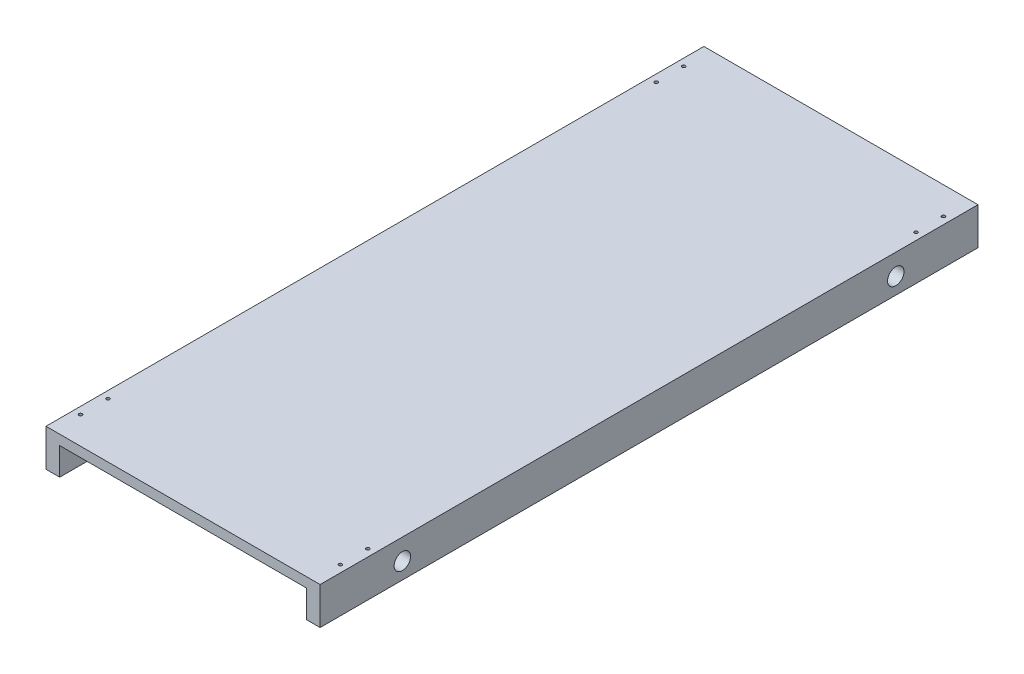
ISO-10303-21;
HEADER;
FILE_DESCRIPTION(('STEP AP214'),'2;1');
FILE_NAME('part.step','',(''),(''),'','','');
FILE_SCHEMA(('AUTOMOTIVE_DESIGN { 1 0 10303 214 1 1 1 1 }'));
ENDSEC;
DATA;
#1=APPLICATION_CONTEXT('core data for automotive mechanical design processes');
#2=APPLICATION_PROTOCOL_DEFINITION('international standard','automotive_design',2000,#1);
#3=PRODUCT_CONTEXT('',#1,'mechanical');
#4=PRODUCT('Part','Part','',(#3));
#5=PRODUCT_RELATED_PRODUCT_CATEGORY('part','',(#4));
#6=PRODUCT_DEFINITION_FORMATION('','',#4);
#7=PRODUCT_DEFINITION_CONTEXT('part definition',#1,'design');
#8=PRODUCT_DEFINITION('design','',#6,#7);
#9=PRODUCT_DEFINITION_SHAPE('','',#8);
#10=(LENGTH_UNIT() NAMED_UNIT(*) SI_UNIT(.MILLI.,.METRE.));
#11=(NAMED_UNIT(*) PLANE_ANGLE_UNIT() SI_UNIT($,.RADIAN.));
#12=(NAMED_UNIT(*) SI_UNIT($,.STERADIAN.) SOLID_ANGLE_UNIT());
#13=UNCERTAINTY_MEASURE_WITH_UNIT(LENGTH_MEASURE(1.E-05),#10,'distance_accuracy_value','');
#14=(GEOMETRIC_REPRESENTATION_CONTEXT(3) GLOBAL_UNCERTAINTY_ASSIGNED_CONTEXT((#13)) GLOBAL_UNIT_ASSIGNED_CONTEXT((#10,
#11,#12)) REPRESENTATION_CONTEXT('',''));
#15=CARTESIAN_POINT('',(0.,0.,0.));
#16=DIRECTION('',(0.,0.,1.));
#17=DIRECTION('',(1.,0.,0.));
#18=AXIS2_PLACEMENT_3D('',#15,#16,#17);
#19=CARTESIAN_POINT('',(25.,0.,1200.));
#20=DIRECTION('',(1.,0.,0.));
#21=DIRECTION('',(0.,1.,0.));
#22=AXIS2_PLACEMENT_3D('',#19,#20,#21);
#23=PLANE('',#22);
#24=CARTESIAN_POINT('',(25.,-20.,1050.));
#25=DIRECTION('',(1.,0.,0.));
#26=DIRECTION('',(0.,1.,0.));
#27=AXIS2_PLACEMENT_3D('',#24,#25,#26);
#28=CIRCLE('',#27,14.9999999999999);
#29=CARTESIAN_POINT('',(25.,-5.00000000000004,1050.));
#30=VERTEX_POINT('',#29);
#31=EDGE_CURVE('E132',#30,#30,#28,.T.);
#32=ORIENTED_EDGE('',*,*,#31,.F.);
#33=EDGE_LOOP('',(#32));
#34=FACE_BOUND('',#33,.T.);
#35=CARTESIAN_POINT('',(25.,-20.,150.));
#36=DIRECTION('',(1.,0.,0.));
#37=DIRECTION('',(0.,1.,0.));
#38=AXIS2_PLACEMENT_3D('',#35,#36,#37);
#39=CIRCLE('',#38,15.);
#40=CARTESIAN_POINT('',(25.,-4.99999999999993,150.));
#41=VERTEX_POINT('',#40);
#42=EDGE_CURVE('E184',#41,#41,#39,.T.);
#43=ORIENTED_EDGE('',*,*,#42,.F.);
#44=EDGE_LOOP('',(#43));
#45=FACE_BOUND('',#44,.T.);
#46=DIRECTION('',(0.,-1.,0.));
#47=VECTOR('',#46,1.);
#48=CARTESIAN_POINT('',(25.,0.,0.));
#49=LINE('',#48,#47);
#50=CARTESIAN_POINT('',(25.,0.,0.));
#51=VERTEX_POINT('',#50);
#52=CARTESIAN_POINT('',(25.,-50.,0.));
#53=VERTEX_POINT('',#52);
#54=EDGE_CURVE('E128',#51,#53,#49,.T.);
#55=ORIENTED_EDGE('',*,*,#54,.F.);
#56=DIRECTION('',(0.,0.,-1.));
#57=VECTOR('',#56,1.);
#58=CARTESIAN_POINT('',(25.,0.,1200.));
#59=LINE('',#58,#57);
#60=CARTESIAN_POINT('',(25.,0.,1200.));
#61=VERTEX_POINT('',#60);
#62=EDGE_CURVE('E11',#61,#51,#59,.T.);
#63=ORIENTED_EDGE('',*,*,#62,.F.);
#64=DIRECTION('',(0.,-1.,0.));
#65=VECTOR('',#64,1.);
#66=CARTESIAN_POINT('',(25.,0.,1200.));
#67=LINE('',#66,#65);
#68=CARTESIAN_POINT('',(25.,-50.,1200.));
#69=VERTEX_POINT('',#68);
#70=EDGE_CURVE('E147',#61,#69,#67,.T.);
#71=ORIENTED_EDGE('',*,*,#70,.T.);
#72=DIRECTION('',(0.,0.,-1.));
#73=VECTOR('',#72,1.);
#74=CARTESIAN_POINT('',(25.,-50.,1200.));
#75=LINE('',#74,#73);
#76=EDGE_CURVE('E83',#69,#53,#75,.T.);
#77=ORIENTED_EDGE('',*,*,#76,.T.);
#78=EDGE_LOOP('',(#55,#63,#71,#77));
#79=FACE_BOUND('',#78,.T.);
#80=ADVANCED_FACE('F33',(#34,#45,#79),#23,.T.);
#81=CARTESIAN_POINT('',(0.,0.,1200.));
#82=DIRECTION('',(0.,1.,0.));
#83=DIRECTION('',(-1.,0.,0.));
#84=AXIS2_PLACEMENT_3D('',#81,#82,#83);
#85=PLANE('',#84);
#86=DIRECTION('',(1.,0.,0.));
#87=VECTOR('',#86,1.);
#88=CARTESIAN_POINT('',(0.,0.,0.));
#89=LINE('',#88,#87);
#90=CARTESIAN_POINT('',(475.,0.,0.));
#91=VERTEX_POINT('',#90);
#92=EDGE_CURVE('E131',#51,#91,#89,.T.);
#93=ORIENTED_EDGE('',*,*,#92,.T.);
#94=DIRECTION('',(0.,0.,-1.));
#95=VECTOR('',#94,1.);
#96=CARTESIAN_POINT('',(475.,0.,1200.));
#97=LINE('',#96,#95);
#98=CARTESIAN_POINT('',(475.,0.,1200.));
#99=VERTEX_POINT('',#98);
#100=EDGE_CURVE('E41',#99,#91,#97,.T.);
#101=ORIENTED_EDGE('',*,*,#100,.F.);
#102=DIRECTION('',(1.,0.,0.));
#103=VECTOR('',#102,1.);
#104=CARTESIAN_POINT('',(0.,0.,1200.));
#105=LINE('',#104,#103);
#106=EDGE_CURVE('E171',#61,#99,#105,.T.);
#107=ORIENTED_EDGE('',*,*,#106,.F.);
#108=ORIENTED_EDGE('',*,*,#62,.T.);
#109=EDGE_LOOP('',(#93,#101,#107,#108));
#110=FACE_BOUND('',#109,.T.);
#111=ADVANCED_FACE('F295',(#110),#85,.F.);
#112=CARTESIAN_POINT('',(475.,-5.27355936696949E-13,1200.));
#113=DIRECTION('',(1.,0.,0.));
#114=DIRECTION('',(0.,1.,0.));
#115=AXIS2_PLACEMENT_3D('',#112,#113,#114);
#116=PLANE('',#115);
#117=CARTESIAN_POINT('',(475.,-20.,1050.));
#118=DIRECTION('',(1.,0.,0.));
#119=DIRECTION('',(0.,1.,0.));
#120=AXIS2_PLACEMENT_3D('',#117,#118,#119);
#121=CIRCLE('',#120,14.9999999999999);
#122=CARTESIAN_POINT('',(475.,-5.00000000000004,1050.));
#123=VERTEX_POINT('',#122);
#124=EDGE_CURVE('E178',#123,#123,#121,.T.);
#125=ORIENTED_EDGE('',*,*,#124,.T.);
#126=EDGE_LOOP('',(#125));
#127=FACE_BOUND('',#126,.T.);
#128=CARTESIAN_POINT('',(475.,-20.,150.));
#129=DIRECTION('',(1.,0.,0.));
#130=DIRECTION('',(0.,1.,0.));
#131=AXIS2_PLACEMENT_3D('',#128,#129,#130);
#132=CIRCLE('',#131,15.);
#133=CARTESIAN_POINT('',(475.,-4.99999999999993,150.));
#134=VERTEX_POINT('',#133);
#135=EDGE_CURVE('E187',#134,#134,#132,.T.);
#136=ORIENTED_EDGE('',*,*,#135,.T.);
#137=EDGE_LOOP('',(#136));
#138=FACE_BOUND('',#137,.T.);
#139=DIRECTION('',(0.,-1.,0.));
#140=VECTOR('',#139,1.);
#141=CARTESIAN_POINT('',(475.,-5.27355936696949E-13,0.));
#142=LINE('',#141,#140);
#143=CARTESIAN_POINT('',(475.,-50.,0.));
#144=VERTEX_POINT('',#143);
#145=EDGE_CURVE('E134',#91,#144,#142,.T.);
#146=ORIENTED_EDGE('',*,*,#145,.T.);
#147=DIRECTION('',(0.,0.,-1.));
#148=VECTOR('',#147,1.);
#149=CARTESIAN_POINT('',(475.,-50.,1200.));
#150=LINE('',#149,#148);
#151=CARTESIAN_POINT('',(475.,-50.,1200.));
#152=VERTEX_POINT('',#151);
#153=EDGE_CURVE('E153',#152,#144,#150,.T.);
#154=ORIENTED_EDGE('',*,*,#153,.F.);
#155=DIRECTION('',(0.,-1.,0.));
#156=VECTOR('',#155,1.);
#157=CARTESIAN_POINT('',(475.,-5.27355936696949E-13,1200.));
#158=LINE('',#157,#156);
#159=EDGE_CURVE('E161',#99,#152,#158,.T.);
#160=ORIENTED_EDGE('',*,*,#159,.F.);
#161=ORIENTED_EDGE('',*,*,#100,.T.);
#162=EDGE_LOOP('',(#146,#154,#160,#161));
#163=FACE_BOUND('',#162,.T.);
#164=ADVANCED_FACE('F159',(#127,#138,#163),#116,.F.);
#165=CARTESIAN_POINT('',(0.,-49.9999999999998,1200.));
#166=DIRECTION('',(0.,-1.,0.));
#167=DIRECTION('',(1.,0.,0.));
#168=AXIS2_PLACEMENT_3D('',#165,#166,#167);
#169=PLANE('',#168);
#170=CARTESIAN_POINT('',(487.,-50.,50.));
#171=DIRECTION('',(0.,1.,0.));
#172=DIRECTION('',(0.,0.,1.));
#173=AXIS2_PLACEMENT_3D('',#170,#171,#172);
#174=CIRCLE('',#173,2.99999999999998);
#175=CARTESIAN_POINT('',(487.,-50.,53.));
#176=VERTEX_POINT('',#175);
#177=EDGE_CURVE('E244',#176,#176,#174,.T.);
#178=ORIENTED_EDGE('',*,*,#177,.T.);
#179=EDGE_LOOP('',(#178));
#180=FACE_BOUND('',#179,.T.);
#181=CARTESIAN_POINT('',(487.,-50.,100.));
#182=DIRECTION('',(0.,1.,0.));
#183=DIRECTION('',(0.,0.,1.));
#184=AXIS2_PLACEMENT_3D('',#181,#182,#183);
#185=CIRCLE('',#184,2.99999999999998);
#186=CARTESIAN_POINT('',(487.,-50.,103.));
#187=VERTEX_POINT('',#186);
#188=EDGE_CURVE('E226',#187,#187,#185,.T.);
#189=ORIENTED_EDGE('',*,*,#188,.T.);
#190=EDGE_LOOP('',(#189));
#191=FACE_BOUND('',#190,.T.);
#192=CARTESIAN_POINT('',(487.,-50.,1150.));
#193=DIRECTION('',(0.,1.,0.));
#194=DIRECTION('',(0.,0.,1.));
#195=AXIS2_PLACEMENT_3D('',#192,#193,#194);
#196=CIRCLE('',#195,2.99999999999998);
#197=CARTESIAN_POINT('',(487.,-50.,1153.));
#198=VERTEX_POINT('',#197);
#199=EDGE_CURVE('E209',#198,#198,#196,.T.);
#200=ORIENTED_EDGE('',*,*,#199,.T.);
#201=EDGE_LOOP('',(#200));
#202=FACE_BOUND('',#201,.T.);
#203=CARTESIAN_POINT('',(487.,-50.,1100.));
#204=DIRECTION('',(0.,1.,0.));
#205=DIRECTION('',(0.,0.,1.));
#206=AXIS2_PLACEMENT_3D('',#203,#204,#205);
#207=CIRCLE('',#206,2.99999999999998);
#208=CARTESIAN_POINT('',(487.,-50.,1103.));
#209=VERTEX_POINT('',#208);
#210=EDGE_CURVE('E210',#209,#209,#207,.T.);
#211=ORIENTED_EDGE('',*,*,#210,.T.);
#212=EDGE_LOOP('',(#211));
#213=FACE_BOUND('',#212,.T.);
#214=DIRECTION('',(-1.,0.,0.));
#215=VECTOR('',#214,1.);
#216=CARTESIAN_POINT('',(0.,-49.9999999999998,0.));
#217=LINE('',#216,#215);
#218=CARTESIAN_POINT('',(500.,-50.,0.));
#219=VERTEX_POINT('',#218);
#220=EDGE_CURVE('E137',#219,#144,#217,.T.);
#221=ORIENTED_EDGE('',*,*,#220,.F.);
#222=DIRECTION('',(0.,0.,-1.));
#223=VECTOR('',#222,1.);
#224=CARTESIAN_POINT('',(500.,-50.,1200.));
#225=LINE('',#224,#223);
#226=CARTESIAN_POINT('',(500.,-50.,1200.));
#227=VERTEX_POINT('',#226);
#228=EDGE_CURVE('E151',#227,#219,#225,.T.);
#229=ORIENTED_EDGE('',*,*,#228,.F.);
#230=DIRECTION('',(-1.,0.,0.));
#231=VECTOR('',#230,1.);
#232=CARTESIAN_POINT('',(0.,-49.9999999999998,1200.));
#233=LINE('',#232,#231);
#234=EDGE_CURVE('E123',#227,#152,#233,.T.);
#235=ORIENTED_EDGE('',*,*,#234,.T.);
#236=ORIENTED_EDGE('',*,*,#153,.T.);
#237=EDGE_LOOP('',(#221,#229,#235,#236));
#238=FACE_BOUND('',#237,.T.);
#239=ADVANCED_FACE('F169',(#180,#191,#202,#213,#238),#169,.T.);
#240=CARTESIAN_POINT('',(500.,0.,1200.));
#241=DIRECTION('',(-1.,0.,0.));
#242=DIRECTION('',(0.,0.,1.));
#243=AXIS2_PLACEMENT_3D('',#240,#241,#242);
#244=PLANE('',#243);
#245=CARTESIAN_POINT('',(500.,-20.,1050.));
#246=DIRECTION('',(-1.,0.,0.));
#247=DIRECTION('',(0.,0.,1.));
#248=AXIS2_PLACEMENT_3D('',#245,#246,#247);
#249=CIRCLE('',#248,14.9999999999999);
#250=CARTESIAN_POINT('',(500.,-20.,1065.));
#251=VERTEX_POINT('',#250);
#252=EDGE_CURVE('E181',#251,#251,#249,.T.);
#253=ORIENTED_EDGE('',*,*,#252,.T.);
#254=EDGE_LOOP('',(#253));
#255=FACE_BOUND('',#254,.T.);
#256=CARTESIAN_POINT('',(500.,-20.,150.));
#257=DIRECTION('',(-1.,0.,0.));
#258=DIRECTION('',(0.,0.,1.));
#259=AXIS2_PLACEMENT_3D('',#256,#257,#258);
#260=CIRCLE('',#259,15.);
#261=CARTESIAN_POINT('',(500.,-20.,165.));
#262=VERTEX_POINT('',#261);
#263=EDGE_CURVE('E190',#262,#262,#260,.T.);
#264=ORIENTED_EDGE('',*,*,#263,.T.);
#265=EDGE_LOOP('',(#264));
#266=FACE_BOUND('',#265,.T.);
#267=DIRECTION('',(0.,1.,0.));
#268=VECTOR('',#267,1.);
#269=CARTESIAN_POINT('',(500.,0.,0.));
#270=LINE('',#269,#268);
#271=CARTESIAN_POINT('',(500.,18.,0.));
#272=VERTEX_POINT('',#271);
#273=EDGE_CURVE('E140',#219,#272,#270,.T.);
#274=ORIENTED_EDGE('',*,*,#273,.T.);
#275=DIRECTION('',(0.,0.,-1.));
#276=VECTOR('',#275,1.);
#277=CARTESIAN_POINT('',(500.,18.,1200.));
#278=LINE('',#277,#276);
#279=CARTESIAN_POINT('',(500.,18.,1200.));
#280=VERTEX_POINT('',#279);
#281=EDGE_CURVE('E111',#280,#272,#278,.T.);
#282=ORIENTED_EDGE('',*,*,#281,.F.);
#283=DIRECTION('',(0.,1.,0.));
#284=VECTOR('',#283,1.);
#285=CARTESIAN_POINT('',(500.,0.,1200.));
#286=LINE('',#285,#284);
#287=EDGE_CURVE('E120',#227,#280,#286,.T.);
#288=ORIENTED_EDGE('',*,*,#287,.F.);
#289=ORIENTED_EDGE('',*,*,#228,.T.);
#290=EDGE_LOOP('',(#274,#282,#288,#289));
#291=FACE_BOUND('',#290,.T.);
#292=ADVANCED_FACE('F259',(#255,#266,#291),#244,.F.);
#293=CARTESIAN_POINT('',(0.,18.,1200.));
#294=DIRECTION('',(0.,1.,0.));
#295=DIRECTION('',(0.,0.,1.));
#296=AXIS2_PLACEMENT_3D('',#293,#294,#295);
#297=PLANE('',#296);
#298=CARTESIAN_POINT('',(487.,18.,50.));
#299=DIRECTION('',(0.,1.,0.));
#300=DIRECTION('',(0.,0.,1.));
#301=AXIS2_PLACEMENT_3D('',#298,#299,#300);
#302=CIRCLE('',#301,2.99999999999999);
#303=CARTESIAN_POINT('',(487.,18.,53.));
#304=VERTEX_POINT('',#303);
#305=EDGE_CURVE('E241',#304,#304,#302,.T.);
#306=ORIENTED_EDGE('',*,*,#305,.F.);
#307=EDGE_LOOP('',(#306));
#308=FACE_BOUND('',#307,.T.);
#309=CARTESIAN_POINT('',(13.,18.,50.));
#310=DIRECTION('',(0.,1.,0.));
#311=DIRECTION('',(0.,0.,1.));
#312=AXIS2_PLACEMENT_3D('',#309,#310,#311);
#313=CIRCLE('',#312,2.99999999999999);
#314=CARTESIAN_POINT('',(13.,18.,53.));
#315=VERTEX_POINT('',#314);
#316=EDGE_CURVE('E235',#315,#315,#313,.T.);
#317=ORIENTED_EDGE('',*,*,#316,.F.);
#318=EDGE_LOOP('',(#317));
#319=FACE_BOUND('',#318,.T.);
#320=CARTESIAN_POINT('',(13.,18.,100.));
#321=DIRECTION('',(0.,1.,0.));
#322=DIRECTION('',(0.,0.,1.));
#323=AXIS2_PLACEMENT_3D('',#320,#321,#322);
#324=CIRCLE('',#323,2.99999999999999);
#325=CARTESIAN_POINT('',(13.,18.,103.));
#326=VERTEX_POINT('',#325);
#327=EDGE_CURVE('E229',#326,#326,#324,.T.);
#328=ORIENTED_EDGE('',*,*,#327,.F.);
#329=EDGE_LOOP('',(#328));
#330=FACE_BOUND('',#329,.T.);
#331=CARTESIAN_POINT('',(487.,18.,100.));
#332=DIRECTION('',(0.,1.,0.));
#333=DIRECTION('',(0.,0.,1.));
#334=AXIS2_PLACEMENT_3D('',#331,#332,#333);
#335=CIRCLE('',#334,2.99999999999999);
#336=CARTESIAN_POINT('',(487.,18.,103.));
#337=VERTEX_POINT('',#336);
#338=EDGE_CURVE('E213',#337,#337,#335,.T.);
#339=ORIENTED_EDGE('',*,*,#338,.F.);
#340=EDGE_LOOP('',(#339));
#341=FACE_BOUND('',#340,.T.);
#342=CARTESIAN_POINT('',(13.,18.,1100.));
#343=DIRECTION('',(0.,1.,0.));
#344=DIRECTION('',(0.,0.,1.));
#345=AXIS2_PLACEMENT_3D('',#342,#343,#344);
#346=CIRCLE('',#345,2.99999999999999);
#347=CARTESIAN_POINT('',(13.,18.,1103.));
#348=VERTEX_POINT('',#347);
#349=EDGE_CURVE('E205',#348,#348,#346,.T.);
#350=ORIENTED_EDGE('',*,*,#349,.F.);
#351=EDGE_LOOP('',(#350));
#352=FACE_BOUND('',#351,.T.);
#353=CARTESIAN_POINT('',(487.,18.,1150.));
#354=DIRECTION('',(0.,1.,0.));
#355=DIRECTION('',(0.,0.,1.));
#356=AXIS2_PLACEMENT_3D('',#353,#354,#355);
#357=CIRCLE('',#356,2.99999999999999);
#358=CARTESIAN_POINT('',(487.,18.,1153.));
#359=VERTEX_POINT('',#358);
#360=EDGE_CURVE('E214',#359,#359,#357,.T.);
#361=ORIENTED_EDGE('',*,*,#360,.F.);
#362=EDGE_LOOP('',(#361));
#363=FACE_BOUND('',#362,.T.);
#364=CARTESIAN_POINT('',(487.,18.,1100.));
#365=DIRECTION('',(0.,1.,0.));
#366=DIRECTION('',(0.,0.,1.));
#367=AXIS2_PLACEMENT_3D('',#364,#365,#366);
#368=CIRCLE('',#367,2.99999999999999);
#369=CARTESIAN_POINT('',(487.,18.,1103.));
#370=VERTEX_POINT('',#369);
#371=EDGE_CURVE('E206',#370,#370,#368,.T.);
#372=ORIENTED_EDGE('',*,*,#371,.F.);
#373=EDGE_LOOP('',(#372));
#374=FACE_BOUND('',#373,.T.);
#375=CARTESIAN_POINT('',(13.,18.,1150.));
#376=DIRECTION('',(0.,1.,0.));
#377=DIRECTION('',(0.,0.,1.));
#378=AXIS2_PLACEMENT_3D('',#375,#376,#377);
#379=CIRCLE('',#378,2.99999999999999);
#380=CARTESIAN_POINT('',(13.,18.,1153.));
#381=VERTEX_POINT('',#380);
#382=EDGE_CURVE('E202',#381,#381,#379,.T.);
#383=ORIENTED_EDGE('',*,*,#382,.F.);
#384=EDGE_LOOP('',(#383));
#385=FACE_BOUND('',#384,.T.);
#386=DIRECTION('',(1.,0.,0.));
#387=VECTOR('',#386,1.);
#388=CARTESIAN_POINT('',(0.,18.,0.));
#389=LINE('',#388,#387);
#390=CARTESIAN_POINT('',(0.,18.,0.));
#391=VERTEX_POINT('',#390);
#392=EDGE_CURVE('E110',#391,#272,#389,.T.);
#393=ORIENTED_EDGE('',*,*,#392,.F.);
#394=DIRECTION('',(0.,0.,-1.));
#395=VECTOR('',#394,1.);
#396=CARTESIAN_POINT('',(0.,18.,1200.));
#397=LINE('',#396,#395);
#398=CARTESIAN_POINT('',(0.,18.,1200.));
#399=VERTEX_POINT('',#398);
#400=EDGE_CURVE('E104',#399,#391,#397,.T.);
#401=ORIENTED_EDGE('',*,*,#400,.F.);
#402=DIRECTION('',(1.,0.,0.));
#403=VECTOR('',#402,1.);
#404=CARTESIAN_POINT('',(0.,18.,1200.));
#405=LINE('',#404,#403);
#406=EDGE_CURVE('E108',#399,#280,#405,.T.);
#407=ORIENTED_EDGE('',*,*,#406,.T.);
#408=ORIENTED_EDGE('',*,*,#281,.T.);
#409=EDGE_LOOP('',(#393,#401,#407,#408));
#410=FACE_BOUND('',#409,.T.);
#411=ADVANCED_FACE('F106',(#308,#319,#330,#341,#352,#363,#374,#385,#410),#297,.T.);
#412=CARTESIAN_POINT('',(0.,0.,1200.));
#413=DIRECTION('',(1.,0.,0.));
#414=DIRECTION('',(0.,1.,0.));
#415=AXIS2_PLACEMENT_3D('',#412,#413,#414);
#416=PLANE('',#415);
#417=CARTESIAN_POINT('',(0.,-20.,1050.));
#418=DIRECTION('',(1.,0.,0.));
#419=DIRECTION('',(0.,0.,-1.));
#420=AXIS2_PLACEMENT_3D('',#417,#418,#419);
#421=CIRCLE('',#420,14.9999999999999);
#422=CARTESIAN_POINT('',(0.,-20.,1035.));
#423=VERTEX_POINT('',#422);
#424=EDGE_CURVE('E193',#423,#423,#421,.T.);
#425=ORIENTED_EDGE('',*,*,#424,.T.);
#426=EDGE_LOOP('',(#425));
#427=FACE_BOUND('',#426,.T.);
#428=CARTESIAN_POINT('',(0.,-20.,150.));
#429=DIRECTION('',(1.,0.,0.));
#430=DIRECTION('',(0.,0.,-1.));
#431=AXIS2_PLACEMENT_3D('',#428,#429,#430);
#432=CIRCLE('',#431,15.);
#433=CARTESIAN_POINT('',(0.,-20.,135.));
#434=VERTEX_POINT('',#433);
#435=EDGE_CURVE('E194',#434,#434,#432,.T.);
#436=ORIENTED_EDGE('',*,*,#435,.T.);
#437=EDGE_LOOP('',(#436));
#438=FACE_BOUND('',#437,.T.);
#439=DIRECTION('',(0.,-1.,0.));
#440=VECTOR('',#439,1.);
#441=CARTESIAN_POINT('',(0.,0.,0.));
#442=LINE('',#441,#440);
#443=CARTESIAN_POINT('',(0.,-50.,0.));
#444=VERTEX_POINT('',#443);
#445=EDGE_CURVE('E76',#391,#444,#442,.T.);
#446=ORIENTED_EDGE('',*,*,#445,.T.);
#447=DIRECTION('',(0.,0.,-1.));
#448=VECTOR('',#447,1.);
#449=CARTESIAN_POINT('',(0.,-50.,1200.));
#450=LINE('',#449,#448);
#451=CARTESIAN_POINT('',(0.,-50.,1200.));
#452=VERTEX_POINT('',#451);
#453=EDGE_CURVE('E112',#452,#444,#450,.T.);
#454=ORIENTED_EDGE('',*,*,#453,.F.);
#455=DIRECTION('',(0.,-1.,0.));
#456=VECTOR('',#455,1.);
#457=CARTESIAN_POINT('',(0.,0.,1200.));
#458=LINE('',#457,#456);
#459=EDGE_CURVE('E114',#399,#452,#458,.T.);
#460=ORIENTED_EDGE('',*,*,#459,.F.);
#461=ORIENTED_EDGE('',*,*,#400,.T.);
#462=EDGE_LOOP('',(#446,#454,#460,#461));
#463=FACE_BOUND('',#462,.T.);
#464=ADVANCED_FACE('F115',(#427,#438,#463),#416,.F.);
#465=CARTESIAN_POINT('',(0.,-50.,1200.));
#466=DIRECTION('',(0.,1.,0.));
#467=DIRECTION('',(0.,0.,1.));
#468=AXIS2_PLACEMENT_3D('',#465,#466,#467);
#469=PLANE('',#468);
#470=CARTESIAN_POINT('',(13.,-50.,50.));
#471=DIRECTION('',(0.,1.,0.));
#472=DIRECTION('',(0.,0.,1.));
#473=AXIS2_PLACEMENT_3D('',#470,#471,#472);
#474=CIRCLE('',#473,2.99999999999998);
#475=CARTESIAN_POINT('',(13.,-50.,53.));
#476=VERTEX_POINT('',#475);
#477=EDGE_CURVE('E238',#476,#476,#474,.T.);
#478=ORIENTED_EDGE('',*,*,#477,.T.);
#479=EDGE_LOOP('',(#478));
#480=FACE_BOUND('',#479,.T.);
#481=CARTESIAN_POINT('',(13.,-50.,100.));
#482=DIRECTION('',(0.,1.,0.));
#483=DIRECTION('',(0.,0.,1.));
#484=AXIS2_PLACEMENT_3D('',#481,#482,#483);
#485=CIRCLE('',#484,2.99999999999998);
#486=CARTESIAN_POINT('',(13.,-50.,103.));
#487=VERTEX_POINT('',#486);
#488=EDGE_CURVE('E232',#487,#487,#485,.T.);
#489=ORIENTED_EDGE('',*,*,#488,.T.);
#490=EDGE_LOOP('',(#489));
#491=FACE_BOUND('',#490,.T.);
#492=CARTESIAN_POINT('',(13.,-50.,1100.));
#493=DIRECTION('',(0.,1.,0.));
#494=DIRECTION('',(0.,0.,1.));
#495=AXIS2_PLACEMENT_3D('',#492,#493,#494);
#496=CIRCLE('',#495,2.99999999999998);
#497=CARTESIAN_POINT('',(13.,-50.,1103.));
#498=VERTEX_POINT('',#497);
#499=EDGE_CURVE('E217',#498,#498,#496,.T.);
#500=ORIENTED_EDGE('',*,*,#499,.T.);
#501=EDGE_LOOP('',(#500));
#502=FACE_BOUND('',#501,.T.);
#503=CARTESIAN_POINT('',(13.,-50.,1150.));
#504=DIRECTION('',(0.,1.,0.));
#505=DIRECTION('',(0.,0.,1.));
#506=AXIS2_PLACEMENT_3D('',#503,#504,#505);
#507=CIRCLE('',#506,2.99999999999998);
#508=CARTESIAN_POINT('',(13.,-50.,1153.));
#509=VERTEX_POINT('',#508);
#510=EDGE_CURVE('E197',#509,#509,#507,.T.);
#511=ORIENTED_EDGE('',*,*,#510,.T.);
#512=EDGE_LOOP('',(#511));
#513=FACE_BOUND('',#512,.T.);
#514=DIRECTION('',(1.,0.,0.));
#515=VECTOR('',#514,1.);
#516=CARTESIAN_POINT('',(0.,-50.,0.));
#517=LINE('',#516,#515);
#518=EDGE_CURVE('E145',#444,#53,#517,.T.);
#519=ORIENTED_EDGE('',*,*,#518,.T.);
#520=ORIENTED_EDGE('',*,*,#76,.F.);
#521=DIRECTION('',(1.,0.,0.));
#522=VECTOR('',#521,1.);
#523=CARTESIAN_POINT('',(0.,-50.,1200.));
#524=LINE('',#523,#522);
#525=EDGE_CURVE('E49',#452,#69,#524,.T.);
#526=ORIENTED_EDGE('',*,*,#525,.F.);
#527=ORIENTED_EDGE('',*,*,#453,.T.);
#528=EDGE_LOOP('',(#519,#520,#526,#527));
#529=FACE_BOUND('',#528,.T.);
#530=ADVANCED_FACE('F305',(#480,#491,#502,#513,#529),#469,.F.);
#531=CARTESIAN_POINT('',(0.,0.,1200.));
#532=DIRECTION('',(0.,0.,1.));
#533=DIRECTION('',(1.,0.,0.));
#534=AXIS2_PLACEMENT_3D('',#531,#532,#533);
#535=PLANE('',#534);
#536=ORIENTED_EDGE('',*,*,#70,.F.);
#537=ORIENTED_EDGE('',*,*,#106,.T.);
#538=ORIENTED_EDGE('',*,*,#159,.T.);
#539=ORIENTED_EDGE('',*,*,#234,.F.);
#540=ORIENTED_EDGE('',*,*,#287,.T.);
#541=ORIENTED_EDGE('',*,*,#406,.F.);
#542=ORIENTED_EDGE('',*,*,#459,.T.);
#543=ORIENTED_EDGE('',*,*,#525,.T.);
#544=EDGE_LOOP('',(#536,#537,#538,#539,#540,#541,#542,#543));
#545=FACE_BOUND('',#544,.T.);
#546=ADVANCED_FACE('F117',(#545),#535,.T.);
#547=CARTESIAN_POINT('',(0.,0.,0.));
#548=DIRECTION('',(0.,0.,1.));
#549=DIRECTION('',(1.,0.,0.));
#550=AXIS2_PLACEMENT_3D('',#547,#548,#549);
#551=PLANE('',#550);
#552=ORIENTED_EDGE('',*,*,#54,.T.);
#553=ORIENTED_EDGE('',*,*,#518,.F.);
#554=ORIENTED_EDGE('',*,*,#445,.F.);
#555=ORIENTED_EDGE('',*,*,#392,.T.);
#556=ORIENTED_EDGE('',*,*,#273,.F.);
#557=ORIENTED_EDGE('',*,*,#220,.T.);
#558=ORIENTED_EDGE('',*,*,#145,.F.);
#559=ORIENTED_EDGE('',*,*,#92,.F.);
#560=EDGE_LOOP('',(#552,#553,#554,#555,#556,#557,#558,#559));
#561=FACE_BOUND('',#560,.T.);
#562=ADVANCED_FACE('F165',(#561),#551,.F.);
#563=CARTESIAN_POINT('',(0.,-20.,150.));
#564=DIRECTION('',(1.,0.,0.));
#565=DIRECTION('',(0.,0.,-1.));
#566=AXIS2_PLACEMENT_3D('',#563,#564,#565);
#567=CYLINDRICAL_SURFACE('',#566,15.);
#568=ORIENTED_EDGE('',*,*,#42,.T.);
#569=EDGE_LOOP('',(#568));
#570=FACE_BOUND('',#569,.T.);
#571=ORIENTED_EDGE('',*,*,#435,.F.);
#572=EDGE_LOOP('',(#571));
#573=FACE_BOUND('',#572,.T.);
#574=ADVANCED_FACE('F337',(#570,#573),#567,.F.);
#575=CARTESIAN_POINT('',(0.,-20.,1050.));
#576=DIRECTION('',(1.,0.,0.));
#577=DIRECTION('',(0.,0.,-1.));
#578=AXIS2_PLACEMENT_3D('',#575,#576,#577);
#579=CYLINDRICAL_SURFACE('',#578,14.9999999999999);
#580=ORIENTED_EDGE('',*,*,#31,.T.);
#581=EDGE_LOOP('',(#580));
#582=FACE_BOUND('',#581,.T.);
#583=ORIENTED_EDGE('',*,*,#424,.F.);
#584=EDGE_LOOP('',(#583));
#585=FACE_BOUND('',#584,.T.);
#586=ADVANCED_FACE('F291',(#582,#585),#579,.F.);
#587=ORIENTED_EDGE('',*,*,#263,.F.);
#588=EDGE_LOOP('',(#587));
#589=FACE_BOUND('',#588,.T.);
#590=ORIENTED_EDGE('',*,*,#135,.F.);
#591=EDGE_LOOP('',(#590));
#592=FACE_BOUND('',#591,.T.);
#593=ADVANCED_FACE('F288',(#589,#592),#567,.F.);
#594=ORIENTED_EDGE('',*,*,#252,.F.);
#595=EDGE_LOOP('',(#594));
#596=FACE_BOUND('',#595,.T.);
#597=ORIENTED_EDGE('',*,*,#124,.F.);
#598=EDGE_LOOP('',(#597));
#599=FACE_BOUND('',#598,.T.);
#600=ADVANCED_FACE('F278',(#596,#599),#579,.F.);
#601=CARTESIAN_POINT('',(13.,18.,1150.));
#602=DIRECTION('',(0.,1.,0.));
#603=DIRECTION('',(0.,0.,1.));
#604=AXIS2_PLACEMENT_3D('',#601,#602,#603);
#605=CYLINDRICAL_SURFACE('',#604,2.99999999999999);
#606=ORIENTED_EDGE('',*,*,#510,.F.);
#607=EDGE_LOOP('',(#606));
#608=FACE_BOUND('',#607,.T.);
#609=ORIENTED_EDGE('',*,*,#382,.T.);
#610=EDGE_LOOP('',(#609));
#611=FACE_BOUND('',#610,.T.);
#612=ADVANCED_FACE('F275',(#608,#611),#605,.F.);
#613=CARTESIAN_POINT('',(13.,18.,1100.));
#614=DIRECTION('',(0.,1.,0.));
#615=DIRECTION('',(0.,0.,1.));
#616=AXIS2_PLACEMENT_3D('',#613,#614,#615);
#617=CYLINDRICAL_SURFACE('',#616,2.99999999999999);
#618=ORIENTED_EDGE('',*,*,#499,.F.);
#619=EDGE_LOOP('',(#618));
#620=FACE_BOUND('',#619,.T.);
#621=ORIENTED_EDGE('',*,*,#349,.T.);
#622=EDGE_LOOP('',(#621));
#623=FACE_BOUND('',#622,.T.);
#624=ADVANCED_FACE('F277',(#620,#623),#617,.F.);
#625=CARTESIAN_POINT('',(487.,18.,1100.));
#626=DIRECTION('',(0.,1.,0.));
#627=DIRECTION('',(0.,0.,1.));
#628=AXIS2_PLACEMENT_3D('',#625,#626,#627);
#629=CYLINDRICAL_SURFACE('',#628,2.99999999999999);
#630=ORIENTED_EDGE('',*,*,#210,.F.);
#631=EDGE_LOOP('',(#630));
#632=FACE_BOUND('',#631,.T.);
#633=ORIENTED_EDGE('',*,*,#371,.T.);
#634=EDGE_LOOP('',(#633));
#635=FACE_BOUND('',#634,.T.);
#636=ADVANCED_FACE('F285',(#632,#635),#629,.F.);
#637=CARTESIAN_POINT('',(487.,18.,1150.));
#638=DIRECTION('',(0.,1.,0.));
#639=DIRECTION('',(0.,0.,1.));
#640=AXIS2_PLACEMENT_3D('',#637,#638,#639);
#641=CYLINDRICAL_SURFACE('',#640,2.99999999999999);
#642=ORIENTED_EDGE('',*,*,#199,.F.);
#643=EDGE_LOOP('',(#642));
#644=FACE_BOUND('',#643,.T.);
#645=ORIENTED_EDGE('',*,*,#360,.T.);
#646=EDGE_LOOP('',(#645));
#647=FACE_BOUND('',#646,.T.);
#648=ADVANCED_FACE('F388',(#644,#647),#641,.F.);
#649=CARTESIAN_POINT('',(487.,18.,100.));
#650=DIRECTION('',(0.,1.,0.));
#651=DIRECTION('',(0.,0.,1.));
#652=AXIS2_PLACEMENT_3D('',#649,#650,#651);
#653=CYLINDRICAL_SURFACE('',#652,2.99999999999999);
#654=ORIENTED_EDGE('',*,*,#188,.F.);
#655=EDGE_LOOP('',(#654));
#656=FACE_BOUND('',#655,.T.);
#657=ORIENTED_EDGE('',*,*,#338,.T.);
#658=EDGE_LOOP('',(#657));
#659=FACE_BOUND('',#658,.T.);
#660=ADVANCED_FACE('F393',(#656,#659),#653,.F.);
#661=CARTESIAN_POINT('',(13.,18.,100.));
#662=DIRECTION('',(0.,1.,0.));
#663=DIRECTION('',(0.,0.,1.));
#664=AXIS2_PLACEMENT_3D('',#661,#662,#663);
#665=CYLINDRICAL_SURFACE('',#664,2.99999999999999);
#666=ORIENTED_EDGE('',*,*,#488,.F.);
#667=EDGE_LOOP('',(#666));
#668=FACE_BOUND('',#667,.T.);
#669=ORIENTED_EDGE('',*,*,#327,.T.);
#670=EDGE_LOOP('',(#669));
#671=FACE_BOUND('',#670,.T.);
#672=ADVANCED_FACE('F457',(#668,#671),#665,.F.);
#673=CARTESIAN_POINT('',(13.,18.,50.));
#674=DIRECTION('',(0.,1.,0.));
#675=DIRECTION('',(0.,0.,1.));
#676=AXIS2_PLACEMENT_3D('',#673,#674,#675);
#677=CYLINDRICAL_SURFACE('',#676,2.99999999999999);
#678=ORIENTED_EDGE('',*,*,#477,.F.);
#679=EDGE_LOOP('',(#678));
#680=FACE_BOUND('',#679,.T.);
#681=ORIENTED_EDGE('',*,*,#316,.T.);
#682=EDGE_LOOP('',(#681));
#683=FACE_BOUND('',#682,.T.);
#684=ADVANCED_FACE('F253',(#680,#683),#677,.F.);
#685=CARTESIAN_POINT('',(487.,18.,50.));
#686=DIRECTION('',(0.,1.,0.));
#687=DIRECTION('',(0.,0.,1.));
#688=AXIS2_PLACEMENT_3D('',#685,#686,#687);
#689=CYLINDRICAL_SURFACE('',#688,2.99999999999999);
#690=ORIENTED_EDGE('',*,*,#177,.F.);
#691=EDGE_LOOP('',(#690));
#692=FACE_BOUND('',#691,.T.);
#693=ORIENTED_EDGE('',*,*,#305,.T.);
#694=EDGE_LOOP('',(#693));
#695=FACE_BOUND('',#694,.T.);
#696=ADVANCED_FACE('F250',(#692,#695),#689,.F.);
#697=CLOSED_SHELL('',(#80,#111,#164,#239,#292,#411,#464,#530,#546,#562,#574,#586,#593,#600,#612,
#624,#636,#648,#660,#672,#684,#696));
#698=MANIFOLD_SOLID_BREP('B2',#697);
#699=ADVANCED_BREP_SHAPE_REPRESENTATION('',(#18,#698),#14);
#700=SHAPE_DEFINITION_REPRESENTATION(#9,#699);
ENDSEC;
END-ISO-10303-21;
